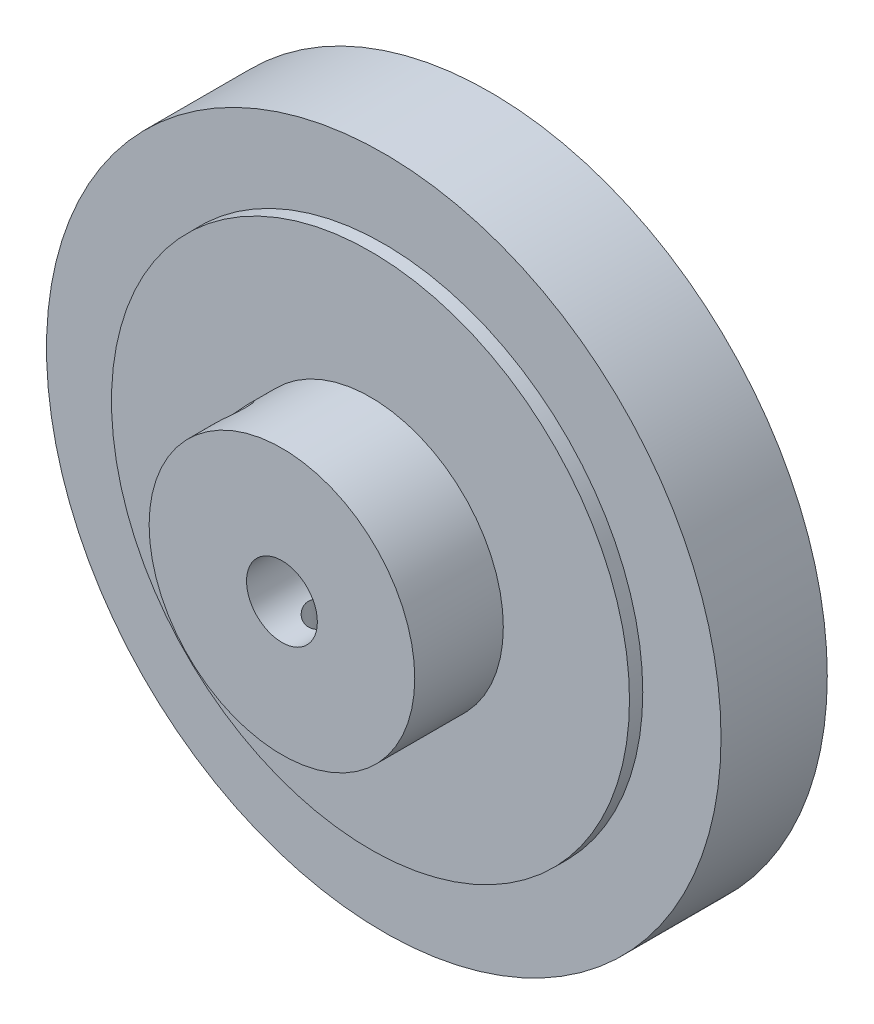
ISO-10303-21;
HEADER;
FILE_DESCRIPTION(('STEP AP214'),'2;1');
FILE_NAME('part.step','',(''),(''),'','','');
FILE_SCHEMA(('AUTOMOTIVE_DESIGN { 1 0 10303 214 1 1 1 1 }'));
ENDSEC;
DATA;
#1=APPLICATION_CONTEXT('core data for automotive mechanical design processes');
#2=APPLICATION_PROTOCOL_DEFINITION('international standard','automotive_design',2000,#1);
#3=PRODUCT_CONTEXT('',#1,'mechanical');
#4=PRODUCT('Part','Part','',(#3));
#5=PRODUCT_RELATED_PRODUCT_CATEGORY('part','',(#4));
#6=PRODUCT_DEFINITION_FORMATION('','',#4);
#7=PRODUCT_DEFINITION_CONTEXT('part definition',#1,'design');
#8=PRODUCT_DEFINITION('design','',#6,#7);
#9=PRODUCT_DEFINITION_SHAPE('','',#8);
#10=(LENGTH_UNIT() NAMED_UNIT(*) SI_UNIT(.MILLI.,.METRE.));
#11=(NAMED_UNIT(*) PLANE_ANGLE_UNIT() SI_UNIT($,.RADIAN.));
#12=(NAMED_UNIT(*) SI_UNIT($,.STERADIAN.) SOLID_ANGLE_UNIT());
#13=UNCERTAINTY_MEASURE_WITH_UNIT(LENGTH_MEASURE(1.E-05),#10,'distance_accuracy_value','');
#14=(GEOMETRIC_REPRESENTATION_CONTEXT(3) GLOBAL_UNCERTAINTY_ASSIGNED_CONTEXT((#13)) GLOBAL_UNIT_ASSIGNED_CONTEXT((#10,
#11,#12)) REPRESENTATION_CONTEXT('',''));
#15=CARTESIAN_POINT('',(0.,0.,0.));
#16=DIRECTION('',(0.,0.,1.));
#17=DIRECTION('',(1.,0.,0.));
#18=AXIS2_PLACEMENT_3D('',#15,#16,#17);
#19=CARTESIAN_POINT('',(0.,0.,6.));
#20=DIRECTION('',(0.,0.,1.));
#21=DIRECTION('',(1.,0.,0.));
#22=AXIS2_PLACEMENT_3D('',#19,#20,#21);
#23=PLANE('',#22);
#24=CARTESIAN_POINT('',(0.,0.,6.));
#25=DIRECTION('',(0.,0.,1.));
#26=DIRECTION('',(1.,0.,0.));
#27=AXIS2_PLACEMENT_3D('',#24,#25,#26);
#28=CIRCLE('',#27,38.087850841627);
#29=CARTESIAN_POINT('',(38.087850841627,0.,6.));
#30=VERTEX_POINT('',#29);
#31=EDGE_CURVE('E12',#30,#30,#28,.T.);
#32=ORIENTED_EDGE('',*,*,#31,.T.);
#33=EDGE_LOOP('',(#32));
#34=FACE_BOUND('',#33,.T.);
#35=CARTESIAN_POINT('',(0.,0.,6.));
#36=DIRECTION('',(0.,0.,1.));
#37=DIRECTION('',(1.,0.,0.));
#38=AXIS2_PLACEMENT_3D('',#35,#36,#37);
#39=CIRCLE('',#38,29.25);
#40=CARTESIAN_POINT('',(29.25,0.,6.));
#41=VERTEX_POINT('',#40);
#42=EDGE_CURVE('E67',#41,#41,#39,.T.);
#43=ORIENTED_EDGE('',*,*,#42,.F.);
#44=EDGE_LOOP('',(#43));
#45=FACE_BOUND('',#44,.T.);
#46=ADVANCED_FACE('F56',(#34,#45),#23,.T.);
#47=CARTESIAN_POINT('',(0.,0.,-6.));
#48=DIRECTION('',(0.,0.,1.));
#49=DIRECTION('',(1.,0.,0.));
#50=AXIS2_PLACEMENT_3D('',#47,#48,#49);
#51=PLANE('',#50);
#52=CARTESIAN_POINT('',(0.,0.,-6.));
#53=DIRECTION('',(0.,0.,1.));
#54=DIRECTION('',(1.,0.,0.));
#55=AXIS2_PLACEMENT_3D('',#52,#53,#54);
#56=CIRCLE('',#55,38.087850841627);
#57=CARTESIAN_POINT('',(38.087850841627,0.,-6.));
#58=VERTEX_POINT('',#57);
#59=EDGE_CURVE('E60',#58,#58,#56,.T.);
#60=ORIENTED_EDGE('',*,*,#59,.F.);
#61=EDGE_LOOP('',(#60));
#62=FACE_BOUND('',#61,.T.);
#63=CARTESIAN_POINT('',(0.,0.,-6.));
#64=DIRECTION('',(0.,0.,1.));
#65=DIRECTION('',(1.,0.,0.));
#66=AXIS2_PLACEMENT_3D('',#63,#64,#65);
#67=CIRCLE('',#66,29.25);
#68=CARTESIAN_POINT('',(29.25,0.,-6.));
#69=VERTEX_POINT('',#68);
#70=EDGE_CURVE('E69',#69,#69,#67,.T.);
#71=ORIENTED_EDGE('',*,*,#70,.T.);
#72=EDGE_LOOP('',(#71));
#73=FACE_BOUND('',#72,.T.);
#74=ADVANCED_FACE('F79',(#62,#73),#51,.F.);
#75=CARTESIAN_POINT('',(0.,0.,6.));
#76=DIRECTION('',(0.,0.,-1.));
#77=DIRECTION('',(-1.,0.,0.));
#78=AXIS2_PLACEMENT_3D('',#75,#76,#77);
#79=CYLINDRICAL_SURFACE('',#78,38.087850841627);
#80=ORIENTED_EDGE('',*,*,#31,.F.);
#81=EDGE_LOOP('',(#80));
#82=FACE_BOUND('',#81,.T.);
#83=ORIENTED_EDGE('',*,*,#59,.T.);
#84=EDGE_LOOP('',(#83));
#85=FACE_BOUND('',#84,.T.);
#86=ADVANCED_FACE('F58',(#82,#85),#79,.T.);
#87=CARTESIAN_POINT('',(0.,0.,6.));
#88=DIRECTION('',(0.,0.,-1.));
#89=DIRECTION('',(-1.,0.,0.));
#90=AXIS2_PLACEMENT_3D('',#87,#88,#89);
#91=CYLINDRICAL_SURFACE('',#90,29.25);
#92=ORIENTED_EDGE('',*,*,#42,.T.);
#93=EDGE_LOOP('',(#92));
#94=FACE_BOUND('',#93,.T.);
#95=ORIENTED_EDGE('',*,*,#70,.F.);
#96=EDGE_LOOP('',(#95));
#97=FACE_BOUND('',#96,.T.);
#98=ADVANCED_FACE('F75',(#94,#97),#91,.F.);
#99=CLOSED_SHELL('',(#46,#74,#86,#98));
#100=MANIFOLD_SOLID_BREP('B2',#99);
#101=CARTESIAN_POINT('',(0.,0.,7.5));
#102=DIRECTION('',(0.,0.,1.));
#103=DIRECTION('',(1.,0.,0.));
#104=AXIS2_PLACEMENT_3D('',#101,#102,#103);
#105=PLANE('',#104);
#106=CARTESIAN_POINT('',(0.,0.,7.5));
#107=DIRECTION('',(0.,0.,1.));
#108=DIRECTION('',(1.,0.,0.));
#109=AXIS2_PLACEMENT_3D('',#106,#107,#108);
#110=CIRCLE('',#109,29.25);
#111=CARTESIAN_POINT('',(29.25,0.,7.5));
#112=VERTEX_POINT('',#111);
#113=EDGE_CURVE('E55',#112,#112,#110,.T.);
#114=ORIENTED_EDGE('',*,*,#113,.T.);
#115=EDGE_LOOP('',(#114));
#116=FACE_BOUND('',#115,.T.);
#117=CARTESIAN_POINT('',(0.,0.,7.5));
#118=DIRECTION('',(0.,0.,1.));
#119=DIRECTION('',(1.,0.,0.));
#120=AXIS2_PLACEMENT_3D('',#117,#118,#119);
#121=CIRCLE('',#120,15.);
#122=CARTESIAN_POINT('',(15.,0.,7.5));
#123=VERTEX_POINT('',#122);
#124=EDGE_CURVE('E268',#123,#123,#121,.F.);
#125=ORIENTED_EDGE('',*,*,#124,.T.);
#126=EDGE_LOOP('',(#125));
#127=FACE_BOUND('',#126,.T.);
#128=ADVANCED_FACE('F147',(#116,#127),#105,.T.);
#129=CARTESIAN_POINT('',(0.,0.,-7.5));
#130=DIRECTION('',(0.,0.,1.));
#131=DIRECTION('',(1.,0.,0.));
#132=AXIS2_PLACEMENT_3D('',#129,#130,#131);
#133=PLANE('',#132);
#134=CARTESIAN_POINT('',(0.,0.,-7.5));
#135=DIRECTION('',(0.,0.,1.));
#136=DIRECTION('',(1.,0.,0.));
#137=AXIS2_PLACEMENT_3D('',#134,#135,#136);
#138=CIRCLE('',#137,4.);
#139=CARTESIAN_POINT('',(4.,0.,-7.5));
#140=VERTEX_POINT('',#139);
#141=EDGE_CURVE('E165',#140,#140,#138,.T.);
#142=ORIENTED_EDGE('',*,*,#141,.T.);
#143=EDGE_LOOP('',(#142));
#144=FACE_BOUND('',#143,.T.);
#145=CARTESIAN_POINT('',(0.,0.,-7.5));
#146=DIRECTION('',(0.,0.,1.));
#147=DIRECTION('',(1.,0.,0.));
#148=AXIS2_PLACEMENT_3D('',#145,#146,#147);
#149=CIRCLE('',#148,29.25);
#150=CARTESIAN_POINT('',(29.25,0.,-7.5));
#151=VERTEX_POINT('',#150);
#152=EDGE_CURVE('E160',#151,#151,#149,.T.);
#153=ORIENTED_EDGE('',*,*,#152,.F.);
#154=EDGE_LOOP('',(#153));
#155=FACE_BOUND('',#154,.T.);
#156=ADVANCED_FACE('F187',(#144,#155),#133,.F.);
#157=CARTESIAN_POINT('',(0.,0.,7.5));
#158=DIRECTION('',(0.,0.,-1.));
#159=DIRECTION('',(-1.,0.,0.));
#160=AXIS2_PLACEMENT_3D('',#157,#158,#159);
#161=CYLINDRICAL_SURFACE('',#160,29.25);
#162=ORIENTED_EDGE('',*,*,#113,.F.);
#163=EDGE_LOOP('',(#162));
#164=FACE_BOUND('',#163,.T.);
#165=ORIENTED_EDGE('',*,*,#152,.T.);
#166=EDGE_LOOP('',(#165));
#167=FACE_BOUND('',#166,.T.);
#168=ADVANCED_FACE('F180',(#164,#167),#161,.T.);
#169=CARTESIAN_POINT('',(0.,0.,7.5));
#170=DIRECTION('',(0.,0.,-1.));
#171=DIRECTION('',(-1.,0.,0.));
#172=AXIS2_PLACEMENT_3D('',#169,#170,#171);
#173=CYLINDRICAL_SURFACE('',#172,4.);
#174=CARTESIAN_POINT('',(-2.68211773936538,2.96753170702211,14.4897913040149));
#175=CARTESIAN_POINT('',(-2.60247658691988,3.03950561769853,14.4789111500052));
#176=CARTESIAN_POINT('',(-2.52046117093615,3.10775252527428,14.4593349794723));
#177=CARTESIAN_POINT('',(-2.35478356226027,3.23511662586228,14.4037000321545));
#178=CARTESIAN_POINT('',(-2.27111793799265,3.29421187781548,14.3676024397434));
#179=CARTESIAN_POINT('',(-2.10568869205158,3.40232184713856,14.2806071712196));
#180=CARTESIAN_POINT('',(-2.02391800954054,3.45138237851424,14.2297794411821));
#181=CARTESIAN_POINT('',(-1.86471356994642,3.53993684182264,14.1148677299191));
#182=CARTESIAN_POINT('',(-1.78727927843582,3.57943195462469,14.0507853868139));
#183=CARTESIAN_POINT('',(-1.63413133043571,3.65202590314484,13.9058721900629));
#184=CARTESIAN_POINT('',(-1.55892600871416,3.68447545478821,13.8241777554469));
#185=CARTESIAN_POINT('',(-1.41974574000493,3.74031509102578,13.6488798318796));
#186=CARTESIAN_POINT('',(-1.35577772336222,3.76369959561589,13.5552690547438));
#187=CARTESIAN_POINT('',(-1.24049378700034,3.80329320999209,13.3541764540075));
#188=CARTESIAN_POINT('',(-1.18974707843153,3.81919790122371,13.2463042299773));
#189=CARTESIAN_POINT('',(-1.10833920908136,3.84362137846534,13.0224826231945));
#190=CARTESIAN_POINT('',(-1.07765007560515,3.85215045604436,12.9065447398918));
#191=CARTESIAN_POINT('',(-1.04149107553757,3.8620731195754,12.6831027336599));
#192=CARTESIAN_POINT('',(-1.03369600705651,3.86412631901979,12.5760045386242));
#193=CARTESIAN_POINT('',(-1.03738912411205,3.86313751608401,12.3621792828687));
#194=CARTESIAN_POINT('',(-1.0488721428707,3.86009687891873,12.2554521303865));
#195=CARTESIAN_POINT('',(-1.08827959302591,3.84915664193169,12.0546813356769));
#196=CARTESIAN_POINT('',(-1.11475422269457,3.84168305390126,11.9603218785873));
#197=CARTESIAN_POINT('',(-1.18111099189795,3.82180198312283,11.7770108157825));
#198=CARTESIAN_POINT('',(-1.22099735776743,3.80939294487964,11.6880609251882));
#199=CARTESIAN_POINT('',(-1.31563226108141,3.77780176365821,11.5102855180073));
#200=CARTESIAN_POINT('',(-1.37131632439094,3.75815615942432,11.4220423272347));
#201=CARTESIAN_POINT('',(-1.4930161672143,3.71148903825109,11.2551258982707));
#202=CARTESIAN_POINT('',(-1.55903823693167,3.68446302317163,11.1764585386726));
#203=CARTESIAN_POINT('',(-1.70698978173929,3.61849104975369,11.021443142041));
#204=CARTESIAN_POINT('',(-1.78987645964506,3.578522589833,10.9464353223854));
#205=CARTESIAN_POINT('',(-1.96179651948145,3.48723638285623,10.8118958152264));
#206=CARTESIAN_POINT('',(-2.05083011365958,3.43591824377098,10.7523646624568));
#207=CARTESIAN_POINT('',(-2.23071055594669,3.32192241440811,10.6512524159522));
#208=CARTESIAN_POINT('',(-2.32153856807974,3.25933368582264,10.6095388108071));
#209=CARTESIAN_POINT('',(-2.50172438613862,3.12315286363814,10.545411001869));
#210=CARTESIAN_POINT('',(-2.5910834502858,3.04957079701447,10.522979335729));
#211=CARTESIAN_POINT('',(-2.7558228423433,2.90112025268051,10.49985385966));
#212=CARTESIAN_POINT('',(-2.83170874646366,2.82711088790442,10.4972163583846));
#213=CARTESIAN_POINT('',(-2.97673481034,2.6739784088401,10.5086921702302));
#214=CARTESIAN_POINT('',(-3.0458761442788,2.59485618866612,10.522802562007));
#215=CARTESIAN_POINT('',(-3.17289529900167,2.43772762081944,10.5661235652493));
#216=CARTESIAN_POINT('',(-3.23112994758997,2.35981995097774,10.5946577359772));
#217=CARTESIAN_POINT('',(-3.33914122599236,2.20433788036981,10.6653215913879));
#218=CARTESIAN_POINT('',(-3.38891622296289,2.12676354675267,10.7074538961816));
#219=CARTESIAN_POINT('',(-3.48282900981359,1.96947251880298,10.8071028830626));
#220=CARTESIAN_POINT('',(-3.52640449291071,1.88993493382665,10.8654296304978));
#221=CARTESIAN_POINT('',(-3.60438820358186,1.73660550246787,10.9944894685931));
#222=CARTESIAN_POINT('',(-3.63879051186681,1.66281738774571,11.0652305214114));
#223=CARTESIAN_POINT('',(-3.70215030842294,1.51690607738248,11.2251135023651));
#224=CARTESIAN_POINT('',(-3.73025971642984,1.44563369795748,11.315373254166));
#225=CARTESIAN_POINT('',(-3.77765089147335,1.31684314496323,11.5073740755893));
#226=CARTESIAN_POINT('',(-3.79693137495444,1.25932697186161,11.6091168119381));
#227=CARTESIAN_POINT('',(-3.82781790594151,1.1620772339537,11.821615784225));
#228=CARTESIAN_POINT('',(-3.83944440089992,1.12229638229173,11.9323471099398));
#229=CARTESIAN_POINT('',(-3.85602262959907,1.06397603260736,12.1596950318305));
#230=CARTESIAN_POINT('',(-3.86098423035868,1.04540514049449,12.2763026623113));
#231=CARTESIAN_POINT('',(-3.8644960510307,1.03232437396246,12.496402954492));
#232=CARTESIAN_POINT('',(-3.86376457388994,1.03511805171536,12.5997301897432));
#233=CARTESIAN_POINT('',(-3.85750110140889,1.05821813025554,12.804255959286));
#234=CARTESIAN_POINT('',(-3.85196851573856,1.07852668461811,12.9054542302392));
#235=CARTESIAN_POINT('',(-3.83604970677892,1.13379762390535,13.098739250685));
#236=CARTESIAN_POINT('',(-3.82587347218039,1.16811986852121,13.1910297067874));
#237=CARTESIAN_POINT('',(-3.80018657316617,1.24915301256108,13.3691844271794));
#238=CARTESIAN_POINT('',(-3.78467413311647,1.29586803452334,13.4550465408292));
#239=CARTESIAN_POINT('',(-3.74558248722239,1.40510770048748,13.6280122795089));
#240=CARTESIAN_POINT('',(-3.72130459179533,1.46880501577173,13.7142171512197));
#241=CARTESIAN_POINT('',(-3.66431005566603,1.60571873302021,13.8756182957449));
#242=CARTESIAN_POINT('',(-3.63158843132963,1.67894074392381,13.9508080260058));
#243=CARTESIAN_POINT('',(-3.55328128830264,1.83925597165375,14.0951484552865));
#244=CARTESIAN_POINT('',(-3.50678110669722,1.92700596011617,14.1630832721656));
#245=CARTESIAN_POINT('',(-3.40176578838745,2.10684825166604,14.2819234023611));
#246=CARTESIAN_POINT('',(-3.34325037634998,2.19894065422413,14.3328283253613));
#247=CARTESIAN_POINT('',(-3.21716698548215,2.37937218497532,14.4135910065632));
#248=CARTESIAN_POINT('',(-3.1501137631261,2.46769719530687,14.4442799658788));
#249=CARTESIAN_POINT('',(-3.00641026079747,2.64084587952315,14.4864792847563));
#250=CARTESIAN_POINT('',(-2.92978663541349,2.72567844010432,14.4980416870763));
#251=CARTESIAN_POINT('',(-2.82248539791167,2.83462491383244,14.500359983861));
#252=CARTESIAN_POINT('',(-2.7948949850676,2.86182819639373,14.4998150304916));
#253=CARTESIAN_POINT('',(-2.73901098154115,2.91535838125762,14.4964841665536));
#254=CARTESIAN_POINT('',(-2.7107174505689,2.94168535753662,14.4936984456492));
#255=CARTESIAN_POINT('',(-2.68211773936538,2.96753170702211,14.4897913040149));
#256=B_SPLINE_CURVE_WITH_KNOTS('',3,(#174,#175,#176,#177,#178,#179,#180,#181,#182,#183,#184,
#185,#186,#187,#188,#189,#190,#191,#192,#193,#194,#195,#196,#197,#198,#199,#200,#201,#202,#203,
#204,#205,#206,#207,#208,#209,#210,#211,#212,#213,#214,#215,#216,#217,#218,#219,#220,#221,#222,
#223,#224,#225,#226,#227,#228,#229,#230,#231,#232,#233,#234,#235,#236,#237,#238,#239,#240,#241,
#242,#243,#244,#245,#246,#247,#248,#249,#250,#251,#252,#253,#254,#255),.UNSPECIFIED.,.T.,.F.,(4,
2,2,2,2,2,2,2,2,2,2,2,2,2,2,2,2,2,2,2,2,2,2,2,2,2,2,2,2,2,2,2,2,2,2,2,2,2,2,2,4),(0.,
0.323524330585441,0.647812686016307,0.970585705725638,1.29331885815042,1.63885985207784,
1.98461320784391,2.34342737660722,2.701740062081,3.02213318910399,3.34244046031204,
3.63605649159951,3.92976513464087,4.24703373615886,4.56449613664261,4.91897860963358,
5.27347332871346,5.625283672541,5.97677506886109,6.29323499039282,6.60963971975531,
6.9124188532336,7.21525636156014,7.53741608590769,7.85978319394344,8.21331984301296,
8.56690787319496,8.91954742606477,9.27166433746787,9.58014720667539,9.88866801139482,
10.1844412961114,10.4803130953886,10.808670176814,11.1372215052887,11.4963926443176,
11.8555720147944,12.1988677049904,12.5412277526643,12.6574175024864,12.7735974187476),.UNSPECIFIED.);
#257=CARTESIAN_POINT('',(-2.68211773936538,2.96753170702211,14.4897913040149));
#258=VERTEX_POINT('',#257);
#259=EDGE_CURVE('E169',#258,#258,#256,.T.);
#260=ORIENTED_EDGE('',*,*,#259,.T.);
#261=EDGE_LOOP('',(#260));
#262=FACE_BOUND('',#261,.T.);
#263=CARTESIAN_POINT('',(0.,-4.,14.5));
#264=CARTESIAN_POINT('',(-0.105143925902467,-3.99999426810082,14.4999933953656));
#265=CARTESIAN_POINT('',(-0.210413199395125,-3.99580982039513,14.4916598537579));
#266=CARTESIAN_POINT('',(-0.417840470537792,-3.97948312074314,14.4586942393169));
#267=CARTESIAN_POINT('',(-0.519992173427259,-3.96732575657839,14.4340312140044));
#268=CARTESIAN_POINT('',(-0.717867089760898,-3.93632558806751,14.3696123827667));
#269=CARTESIAN_POINT('',(-0.813613605878293,-3.91750878355075,14.3299152315041));
#270=CARTESIAN_POINT('',(-0.996945233613197,-3.87491553031523,14.23685875727));
#271=CARTESIAN_POINT('',(-1.08453098798012,-3.85113947267051,14.1835005115023));
#272=CARTESIAN_POINT('',(-1.25501563552382,-3.79912516516124,14.0609655010294));
#273=CARTESIAN_POINT('',(-1.33731042224422,-3.77070398255074,13.9910270415207));
#274=CARTESIAN_POINT('',(-1.48955888973396,-3.71319940493486,13.8389570415059));
#275=CARTESIAN_POINT('',(-1.55950316621353,-3.68411552418069,13.7568162964551));
#276=CARTESIAN_POINT('',(-1.69050400090055,-3.62597902394695,13.5750333009532));
#277=CARTESIAN_POINT('',(-1.75045067110327,-3.59710373940264,13.4745278033082));
#278=CARTESIAN_POINT('',(-1.85233645378139,-3.54571957544641,13.2632653280276));
#279=CARTESIAN_POINT('',(-1.89428842993267,-3.52320615213979,13.1525157425545));
#280=CARTESIAN_POINT('',(-1.95626488437718,-3.48915734075617,12.9306697891562));
#281=CARTESIAN_POINT('',(-1.97745171416088,-3.47704543167427,12.8199910958652));
#282=CARTESIAN_POINT('',(-2.00085398661769,-3.46363779897055,12.596042324441));
#283=CARTESIAN_POINT('',(-2.00308817674615,-3.46233138686576,12.4827749182577));
#284=CARTESIAN_POINT('',(-1.98937457434459,-3.47021860514497,12.2714279513693));
#285=CARTESIAN_POINT('',(-1.97556911907364,-3.47817527324027,12.1731519375539));
#286=CARTESIAN_POINT('',(-1.93387969811386,-3.50152457467701,11.9805561812539));
#287=CARTESIAN_POINT('',(-1.9059912477953,-3.51691957663553,11.8862377093894));
#288=CARTESIAN_POINT('',(-1.83641956077201,-3.55374952825482,11.7015417348687));
#289=CARTESIAN_POINT('',(-1.79443013423199,-3.57531681327997,11.6113072024284));
#290=CARTESIAN_POINT('',(-1.698083375336,-3.62206808562807,11.43873141482));
#291=CARTESIAN_POINT('',(-1.64372048762493,-3.64725369560381,11.3563937287998));
#292=CARTESIAN_POINT('',(-1.51613210982558,-3.70226315806572,11.1909574945135));
#293=CARTESIAN_POINT('',(-1.44138891673856,-3.73227020473492,11.1090862528477));
#294=CARTESIAN_POINT('',(-1.27911115748275,-3.79095246600814,10.9585291628182));
#295=CARTESIAN_POINT('',(-1.19157051314857,-3.81962703917602,10.8898496159322));
#296=CARTESIAN_POINT('',(-1.0010330116637,-3.87403974565928,10.7646286779405));
#297=CARTESIAN_POINT('',(-0.897507183198818,-3.89957968324015,10.7087990551085));
#298=CARTESIAN_POINT('',(-0.680932430977594,-3.94315762242485,10.615805941914));
#299=CARTESIAN_POINT('',(-0.567891152530552,-3.96120157887106,10.5786276299697));
#300=CARTESIAN_POINT('',(-0.345532983321404,-3.98648667482871,10.5270491925666));
#301=CARTESIAN_POINT('',(-0.236683061096652,-3.9944987660262,10.5110175285064));
#302=CARTESIAN_POINT('',(-0.0175591998987035,-4.00146026918207,10.497070537731));
#303=CARTESIAN_POINT('',(0.0927140397398173,-4.00041397442637,10.4991466287211));
#304=CARTESIAN_POINT('',(0.302465943971974,-3.9898238450687,10.5204133768375));
#305=CARTESIAN_POINT('',(0.40211881609986,-3.98094491376337,10.53826506546));
#306=CARTESIAN_POINT('',(0.596813784603882,-3.9564434262968,10.5884761437902));
#307=CARTESIAN_POINT('',(0.691855371382174,-3.94082012668824,10.620837132907));
#308=CARTESIAN_POINT('',(0.877777216899145,-3.90368502827176,10.6999969328661));
#309=CARTESIAN_POINT('',(0.968460794011607,-3.88201763539262,10.7471821002326));
#310=CARTESIAN_POINT('',(1.14092272339854,-3.83487948634835,10.8542150712931));
#311=CARTESIAN_POINT('',(1.22269725955318,-3.80940711133877,10.9140682691908));
#312=CARTESIAN_POINT('',(1.38353537857843,-3.75416442672396,11.0515208506614));
#313=CARTESIAN_POINT('',(1.46154415563805,-3.72421769686998,11.1302857368903));
#314=CARTESIAN_POINT('',(1.60371264223771,-3.6652478321764,11.2998503025555));
#315=CARTESIAN_POINT('',(1.66786277142375,-3.63622534800094,11.3906582376958));
#316=CARTESIAN_POINT('',(1.78341582895804,-3.58102384412979,11.587287308346));
#317=CARTESIAN_POINT('',(1.8340509916005,-3.55505059178121,11.693622532189));
#318=CARTESIAN_POINT('',(1.91616565186941,-3.51148144588269,11.9150201351499));
#319=CARTESIAN_POINT('',(1.94766983173403,-3.493874764435,12.0300710529338));
#320=CARTESIAN_POINT('',(1.98772337493374,-3.47123002051604,12.2538204457694));
#321=CARTESIAN_POINT('',(1.9981859928109,-3.4651476693013,12.3620685068705));
#322=CARTESIAN_POINT('',(2.0013783087524,-3.46330709283207,12.578894134329));
#323=CARTESIAN_POINT('',(1.99411569324648,-3.4675443925278,12.6874715374757));
#324=CARTESIAN_POINT('',(1.96385225118662,-3.48475724102153,12.8909670030669));
#325=CARTESIAN_POINT('',(1.94241662868607,-3.49686188965317,12.9862009402895));
#326=CARTESIAN_POINT('',(1.88635071644882,-3.52742032375305,13.1716162388487));
#327=CARTESIAN_POINT('',(1.85171618231984,-3.54587615139337,13.2617959641841));
#328=CARTESIAN_POINT('',(1.76763149060113,-3.58857060729071,13.4412497019731));
#329=CARTESIAN_POINT('',(1.7173422756314,-3.61311444791841,13.5300558036581));
#330=CARTESIAN_POINT('',(1.60430194327478,-3.66470663269721,13.6985490723625));
#331=CARTESIAN_POINT('',(1.54154434248312,-3.69175627591221,13.7782314610422));
#332=CARTESIAN_POINT('',(1.39640665332275,-3.74924646316184,13.9362839647094));
#333=CARTESIAN_POINT('',(1.31256884599452,-3.77969966613256,14.0133182047006));
#334=CARTESIAN_POINT('',(1.1323096124664,-3.83755504519861,14.1525259668705));
#335=CARTESIAN_POINT('',(1.0358814466104,-3.8649555725239,14.2146914789398));
#336=CARTESIAN_POINT('',(0.831863193565892,-3.91396019133075,14.3224727254241));
#337=CARTESIAN_POINT('',(0.724199007553462,-3.93552192987866,14.3679683384729));
#338=CARTESIAN_POINT('',(0.501484202276173,-3.97002682597974,14.4396163355148));
#339=CARTESIAN_POINT('',(0.3864555991782,-3.98299446726136,14.4658236936114));
#340=CARTESIAN_POINT('',(0.22520389298179,-3.99390923826956,14.4877948221715));
#341=CARTESIAN_POINT('',(0.18032375888313,-3.99618730680502,14.4923652817327));
#342=CARTESIAN_POINT('',(0.0903034636101832,-3.99923393953631,14.4984693310282));
#343=CARTESIAN_POINT('',(0.0451632952932569,-4.00000246206762,14.5000028369404));
#344=CARTESIAN_POINT('',(0.,-4.,14.5));
#345=B_SPLINE_CURVE_WITH_KNOTS('',3,(#263,#264,#265,#266,#267,#268,#269,#270,#271,#272,#273,
#274,#275,#276,#277,#278,#279,#280,#281,#282,#283,#284,#285,#286,#287,#288,#289,#290,#291,#292,
#293,#294,#295,#296,#297,#298,#299,#300,#301,#302,#303,#304,#305,#306,#307,#308,#309,#310,#311,
#312,#313,#314,#315,#316,#317,#318,#319,#320,#321,#322,#323,#324,#325,#326,#327,#328,#329,#330,
#331,#332,#333,#334,#335,#336,#337,#338,#339,#340,#341,#342,#343,#344),.UNSPECIFIED.,.T.,.F.,(4,
2,2,2,2,2,2,2,2,2,2,2,2,2,2,2,2,2,2,2,2,2,2,2,2,2,2,2,2,2,2,2,2,2,2,2,2,2,2,2,4),(0.,
0.315248514840585,0.631096299418395,0.945724310984596,1.26032752116314,1.59396351743618,
1.92785247530807,2.28763452861505,2.64715895796562,2.98516024280459,3.32282714658041,
3.62011424818641,3.91749607851357,4.22180480336975,4.52625042520444,4.86929882667757,
5.21251069197373,5.57166044428881,5.93052433824559,6.25966580942691,6.58865129022952,
6.89213813012244,7.19565843261863,7.50785712055797,7.82018901496678,8.16319221288837,
8.50643177230863,8.86629364323451,9.22569023890902,9.55058615006093,9.87534119729357,
10.1691586049771,10.463070575767,10.7767291356057,11.0905512228726,11.4425048551434,
11.7946476676249,12.1492802732705,12.502898172423,12.6383056026783,12.7737167702213),.UNSPECIFIED.);
#346=CARTESIAN_POINT('',(0.,-4.,14.5));
#347=VERTEX_POINT('',#346);
#348=EDGE_CURVE('E242',#347,#347,#345,.T.);
#349=ORIENTED_EDGE('',*,*,#348,.T.);
#350=EDGE_LOOP('',(#349));
#351=FACE_BOUND('',#350,.T.);
#352=ORIENTED_EDGE('',*,*,#141,.F.);
#353=EDGE_LOOP('',(#352));
#354=FACE_BOUND('',#353,.T.);
#355=CARTESIAN_POINT('',(0.,0.,17.5));
#356=DIRECTION('',(0.,0.,1.));
#357=DIRECTION('',(1.,0.,0.));
#358=AXIS2_PLACEMENT_3D('',#355,#356,#357);
#359=CIRCLE('',#358,4.);
#360=CARTESIAN_POINT('',(4.,0.,17.5));
#361=VERTEX_POINT('',#360);
#362=EDGE_CURVE('E249',#361,#361,#359,.T.);
#363=ORIENTED_EDGE('',*,*,#362,.T.);
#364=EDGE_LOOP('',(#363));
#365=FACE_BOUND('',#364,.T.);
#366=ADVANCED_FACE('F175',(#262,#351,#354,#365),#173,.F.);
#367=CARTESIAN_POINT('',(0.,0.,17.5));
#368=DIRECTION('',(0.,0.,1.));
#369=DIRECTION('',(1.,0.,0.));
#370=AXIS2_PLACEMENT_3D('',#367,#368,#369);
#371=PLANE('',#370);
#372=CARTESIAN_POINT('',(0.,0.,17.5));
#373=DIRECTION('',(0.,0.,1.));
#374=DIRECTION('',(1.,0.,0.));
#375=AXIS2_PLACEMENT_3D('',#372,#373,#374);
#376=CIRCLE('',#375,15.);
#377=CARTESIAN_POINT('',(15.,0.,17.5));
#378=VERTEX_POINT('',#377);
#379=EDGE_CURVE('E266',#378,#378,#376,.T.);
#380=ORIENTED_EDGE('',*,*,#379,.T.);
#381=EDGE_LOOP('',(#380));
#382=FACE_BOUND('',#381,.T.);
#383=ORIENTED_EDGE('',*,*,#362,.F.);
#384=EDGE_LOOP('',(#383));
#385=FACE_BOUND('',#384,.T.);
#386=ADVANCED_FACE('F179',(#382,#385),#371,.T.);
#387=CARTESIAN_POINT('',(0.,0.,17.5));
#388=DIRECTION('',(0.,0.,-1.));
#389=DIRECTION('',(-1.,0.,0.));
#390=AXIS2_PLACEMENT_3D('',#387,#388,#389);
#391=CYLINDRICAL_SURFACE('',#390,15.);
#392=CARTESIAN_POINT('',(-10.7661580980777,10.4446081691558,14.4870336739988));
#393=CARTESIAN_POINT('',(-10.688947711126,10.5241931887288,14.4997156373459));
#394=CARTESIAN_POINT('',(-10.6100607690926,10.6037267537695,14.5031061922901));
#395=CARTESIAN_POINT('',(-10.4511852816755,10.7603532601567,14.4911579239387));
#396=CARTESIAN_POINT('',(-10.3711957347132,10.8374437394201,14.4758007867033));
#397=CARTESIAN_POINT('',(-10.212605077598,10.9870183186256,14.4268111394454));
#398=CARTESIAN_POINT('',(-10.1340031647207,11.0595051492592,14.3931895783567));
#399=CARTESIAN_POINT('',(-9.98061517779606,11.1981256530406,14.3086679010773));
#400=CARTESIAN_POINT('',(-9.9058285106678,11.2642603150542,14.2577704798956));
#401=CARTESIAN_POINT('',(-9.76215398580282,11.3890057806529,14.1398818212413));
#402=CARTESIAN_POINT('',(-9.69329392138029,11.447581716015,14.0728198249301));
#403=CARTESIAN_POINT('',(-9.56417081183656,11.555680053993,13.9245961087988));
#404=CARTESIAN_POINT('',(-9.50390836544524,11.6052018261531,13.8434334078911));
#405=CARTESIAN_POINT('',(-9.39374120747958,11.6945587094088,13.668679259263));
#406=CARTESIAN_POINT('',(-9.34390640121057,11.7343287334416,13.5750104191649));
#407=CARTESIAN_POINT('',(-9.2569440189863,11.8030535266452,13.378275708599));
#408=CARTESIAN_POINT('',(-9.21981617339458,11.8320085253075,13.2752100375869));
#409=CARTESIAN_POINT('',(-9.15979285440346,11.8785370596925,13.06290723072));
#410=CARTESIAN_POINT('',(-9.13685608036885,11.896143629345,12.9536890226801));
#411=CARTESIAN_POINT('',(-9.10596136805465,11.9198092503977,12.7319353148835));
#412=CARTESIAN_POINT('',(-9.09800257522772,11.9258689605878,12.6194000047514));
#413=CARTESIAN_POINT('',(-9.09738751312324,11.9263380557723,12.3951567678502));
#414=CARTESIAN_POINT('',(-9.10461075564075,11.9208391724586,12.2834493340349));
#415=CARTESIAN_POINT('',(-9.13382533653886,11.898469149479,12.0631498872992));
#416=CARTESIAN_POINT('',(-9.15581666677761,11.8815980160829,11.9545578726613));
#417=CARTESIAN_POINT('',(-9.21368754737939,11.8367770323118,11.7436009690489));
#418=CARTESIAN_POINT('',(-9.24956027395288,11.808832625153,11.6412330490117));
#419=CARTESIAN_POINT('',(-9.33383324190496,11.7423347651465,11.4454945275332));
#420=CARTESIAN_POINT('',(-9.38223411333035,11.7037807787316,11.3521243789185));
#421=CARTESIAN_POINT('',(-9.49021706405742,11.6163947485229,11.1762618202449));
#422=CARTESIAN_POINT('',(-9.5498822143261,11.5674859930613,11.0938585222196));
#423=CARTESIAN_POINT('',(-9.67803484835171,11.4604797320359,10.943066203399));
#424=CARTESIAN_POINT('',(-9.74652257046266,11.402381978209,10.8746775613585));
#425=CARTESIAN_POINT('',(-9.89026989237633,11.2779262604085,10.7536009131129));
#426=CARTESIAN_POINT('',(-9.96555493872656,11.21153686775,10.7009753824178));
#427=CARTESIAN_POINT('',(-10.1201668670294,11.072174213347,10.6133195869462));
#428=CARTESIAN_POINT('',(-10.1994935806849,10.9992012256492,10.5782885901831));
#429=CARTESIAN_POINT('',(-10.3591811691332,10.8489312578131,10.5270163237761));
#430=CARTESIAN_POINT('',(-10.4395332801586,10.7716620681485,10.5106663408865));
#431=CARTESIAN_POINT('',(-10.5992875258746,10.6145021295755,10.4968812443417));
#432=CARTESIAN_POINT('',(-10.6786897013873,10.5346114938761,10.4994453149369));
#433=CARTESIAN_POINT('',(-10.8337771540356,10.3750458500873,10.5233306714776));
#434=CARTESIAN_POINT('',(-10.9094830631177,10.2953727631526,10.5445311367977));
#435=CARTESIAN_POINT('',(-11.0557514309998,10.138140728662,10.6048954792004));
#436=CARTESIAN_POINT('',(-11.1263137908556,10.0605818217936,10.6440597017384));
#437=CARTESIAN_POINT('',(-11.2608159974978,9.90980675706159,10.7393561266196));
#438=CARTESIAN_POINT('',(-11.3247360539117,9.83660383975302,10.7955371868659));
#439=CARTESIAN_POINT('',(-11.444346356976,9.69718448131303,10.9232380301712));
#440=CARTESIAN_POINT('',(-11.500036167655,9.63096841034095,10.9947586253021));
#441=CARTESIAN_POINT('',(-11.6024945136371,9.50729370318593,11.1517718887953));
#442=CARTESIAN_POINT('',(-11.6491901019801,9.44990737642319,11.2373691523531));
#443=CARTESIAN_POINT('',(-11.7322566539833,9.34658026377952,11.4197533533245));
#444=CARTESIAN_POINT('',(-11.7686275762398,9.30063952379746,11.5165403356085));
#445=CARTESIAN_POINT('',(-11.8304300134041,9.22190028312033,11.7186697036973));
#446=CARTESIAN_POINT('',(-11.855854103679,9.18911070316153,11.8240178386711));
#447=CARTESIAN_POINT('',(-11.8952893931551,9.13800534425215,12.0402167303812));
#448=CARTESIAN_POINT('',(-11.9093011978581,9.11968879740722,12.1510671948493));
#449=CARTESIAN_POINT('',(-11.9256123628447,9.09834884442504,12.3742190081587));
#450=CARTESIAN_POINT('',(-11.9280002159312,9.09520989293506,12.4865028490726));
#451=CARTESIAN_POINT('',(-11.9212633121226,9.10403814632153,12.710124941947));
#452=CARTESIAN_POINT('',(-11.9121388342919,9.1160049850265,12.8214632167626));
#453=CARTESIAN_POINT('',(-11.8825908730846,9.15448592856406,13.0395786317473));
#454=CARTESIAN_POINT('',(-11.8622126651343,9.18094173860331,13.1463722135468));
#455=CARTESIAN_POINT('',(-11.8105293205721,9.2473323775659,13.3528870644681));
#456=CARTESIAN_POINT('',(-11.7792240993552,9.28726731085469,13.4526082788231));
#457=CARTESIAN_POINT('',(-11.706003510779,9.37938970294042,13.6427888501894));
#458=CARTESIAN_POINT('',(-11.6640276765163,9.43164686130265,13.733191152958));
#459=CARTESIAN_POINT('',(-11.5702873639856,9.54640900835212,13.9016008569697));
#460=CARTESIAN_POINT('',(-11.5185204291156,9.60891656835602,13.9796051384719));
#461=CARTESIAN_POINT('',(-11.4057952531842,9.74245937110945,14.1215319866491));
#462=CARTESIAN_POINT('',(-11.3447750749136,9.81355136646423,14.1853519177557));
#463=CARTESIAN_POINT('',(-11.2151307496104,9.96144924771843,14.2963361103775));
#464=CARTESIAN_POINT('',(-11.1465146169201,10.0382490837856,14.3435177107068));
#465=CARTESIAN_POINT('',(-11.0258734382449,10.1703209524408,14.4078762166684));
#466=CARTESIAN_POINT('',(-10.9754243726353,10.2247600935445,14.4298229382834));
#467=CARTESIAN_POINT('',(-10.8723042975137,10.3343437769157,14.4650099288388));
#468=CARTESIAN_POINT('',(-10.8196333044981,10.3894883139439,14.4782502624065));
#469=CARTESIAN_POINT('',(-10.7661580980777,10.4446081691558,14.4870336739988));
#470=B_SPLINE_CURVE_WITH_KNOTS('',3,(#392,#393,#394,#395,#396,#397,#398,#399,#400,#401,#402,
#403,#404,#405,#406,#407,#408,#409,#410,#411,#412,#413,#414,#415,#416,#417,#418,#419,#420,#421,
#422,#423,#424,#425,#426,#427,#428,#429,#430,#431,#432,#433,#434,#435,#436,#437,#438,#439,#440,
#441,#442,#443,#444,#445,#446,#447,#448,#449,#450,#451,#452,#453,#454,#455,#456,#457,#458,#459,
#460,#461,#462,#463,#464,#465,#466,#467,#468,#469),.UNSPECIFIED.,.T.,.F.,(4,2,2,2,2,2,2,2,2,2,2,
2,2,2,2,2,2,2,2,2,2,2,2,2,2,2,2,2,2,2,2,2,2,2,2,2,2,2,4),(0.,0.334538838789927,
0.669404738089608,1.00407011723376,1.33868331304148,1.67478873070454,2.01091754301376,
2.34923221657736,2.68753971079819,3.02485793081562,3.36215690503968,3.69678910652283,
4.03142112351836,4.36588885130716,4.7003734029174,5.03742852927396,5.37449276355235,
5.71287575962231,6.05124467675452,6.38763427949453,6.72400937407623,7.05821968424849,
7.39243642178318,7.72762199122631,8.06282530971306,8.40064228426985,8.73846061351129,
9.07650770676018,9.41453686307162,9.74998854503294,10.0854320956434,10.4195358362164,
10.7536421637295,11.0896856937789,11.425813649772,11.7642998474866,12.1024322588557,
12.3341325126957,12.5658310466134),.UNSPECIFIED.);
#471=CARTESIAN_POINT('',(-10.7661580980777,10.4446081691558,14.4870336739988));
#472=VERTEX_POINT('',#471);
#473=EDGE_CURVE('E152',#472,#472,#470,.T.);
#474=ORIENTED_EDGE('',*,*,#473,.F.);
#475=EDGE_LOOP('',(#474));
#476=FACE_BOUND('',#475,.T.);
#477=CARTESIAN_POINT('',(0.,-15.,14.5));
#478=CARTESIAN_POINT('',(-0.111808835669284,-14.9999983574254,14.4999952902931));
#479=CARTESIAN_POINT('',(-0.22368597927628,-14.9987367072719,14.4905924620375));
#480=CARTESIAN_POINT('',(-0.444322725138079,-14.993825111269,14.4532336509504));
#481=CARTESIAN_POINT('',(-0.553079022333037,-14.9901727244172,14.4252587051029));
#482=CARTESIAN_POINT('',(-0.764248312626984,-14.9808907984907,14.3515982824586));
#483=CARTESIAN_POINT('',(-0.866665683058495,-14.9752626421097,14.3059251889616));
#484=CARTESIAN_POINT('',(-1.0623638950303,-14.9626538666039,14.1981930861937));
#485=CARTESIAN_POINT('',(-1.15564620633703,-14.9556734655857,14.1361367188335));
#486=CARTESIAN_POINT('',(-1.33102582250468,-14.9410899478996,13.9969867383958));
#487=CARTESIAN_POINT('',(-1.41305798549586,-14.9334835816211,13.9198113549915));
#488=CARTESIAN_POINT('',(-1.56304735673102,-14.9185313755795,13.7527898109233));
#489=CARTESIAN_POINT('',(-1.63100381997221,-14.9111855496234,13.6629429800042));
#490=CARTESIAN_POINT('',(-1.75115902268907,-14.8975543544019,13.472700877055));
#491=CARTESIAN_POINT('',(-1.80329607482578,-14.8912731776576,13.3722663175214));
#492=CARTESIAN_POINT('',(-1.8899384500729,-14.8805258737923,13.1639689327632));
#493=CARTESIAN_POINT('',(-1.92444453245278,-14.8760596685121,13.0561064276467));
#494=CARTESIAN_POINT('',(-1.97464606772174,-14.8694793656867,12.8366941894983));
#495=CARTESIAN_POINT('',(-1.99045204228506,-14.8673514537014,12.7251701654671));
#496=CARTESIAN_POINT('',(-2.00314680548117,-14.8656465160931,12.501033820394));
#497=CARTESIAN_POINT('',(-2.00003645633601,-14.866069374204,12.3884215491891));
#498=CARTESIAN_POINT('',(-1.97507745939234,-14.8694055577299,12.1660788699721));
#499=CARTESIAN_POINT('',(-1.95335097531762,-14.8723026462234,12.0563344701143));
#500=CARTESIAN_POINT('',(-1.89196724634371,-14.8802355277475,11.8420631632399));
#501=CARTESIAN_POINT('',(-1.85230959261457,-14.8852713695413,11.737536375245));
#502=CARTESIAN_POINT('',(-1.75605929143191,-14.8969326111103,11.5362903652928));
#503=CARTESIAN_POINT('',(-1.69941397913749,-14.903562941239,11.4395966288057));
#504=CARTESIAN_POINT('',(-1.57083393344289,-14.9176623621993,11.2570409180823));
#505=CARTESIAN_POINT('',(-1.49889840502385,-14.9251314966353,11.1711795074458));
#506=CARTESIAN_POINT('',(-1.34110490026362,-14.9401389923359,11.0120169874181));
#507=CARTESIAN_POINT('',(-1.25514170702645,-14.947677435412,10.9388201572977));
#508=CARTESIAN_POINT('',(-1.07209417013341,-14.9619192381826,10.8078779550716));
#509=CARTESIAN_POINT('',(-0.975009794442369,-14.9686225954715,10.7501326274765));
#510=CARTESIAN_POINT('',(-0.772392219730469,-14.9804439374358,10.6517308823053));
#511=CARTESIAN_POINT('',(-0.66685557884123,-14.9855612720896,10.6110814689537));
#512=CARTESIAN_POINT('',(-0.450370924336249,-14.9936282590407,10.5481106810277));
#513=CARTESIAN_POINT('',(-0.339423199542257,-14.9965780268993,10.5257883293606));
#514=CARTESIAN_POINT('',(-0.116166903325644,-14.9999624137686,10.5002415672289));
#515=CARTESIAN_POINT('',(-0.00387503454704219,-15.0004159384905,10.4968735982165));
#516=CARTESIAN_POINT('',(0.219671617218718,-14.9988079153852,10.5089516641272));
#517=CARTESIAN_POINT('',(0.330926425345665,-14.996746428686,10.5243972417824));
#518=CARTESIAN_POINT('',(0.548813715572939,-14.990351753581,10.573544653384));
#519=CARTESIAN_POINT('',(0.655462016512045,-14.9860271430292,10.6071775683222));
#520=CARTESIAN_POINT('',(0.86160509879356,-14.9755900925429,10.6916729659371));
#521=CARTESIAN_POINT('',(0.961099607015638,-14.9694775843944,10.7425361060133));
#522=CARTESIAN_POINT('',(1.15074887861608,-14.9560983737007,10.8603921555833));
#523=CARTESIAN_POINT('',(1.2408458143966,-14.9488251504572,10.9274773657133));
#524=CARTESIAN_POINT('',(1.4085529469919,-14.9339572870998,11.0757433292243));
#525=CARTESIAN_POINT('',(1.48616257662379,-14.9263626324062,11.1569247225164));
#526=CARTESIAN_POINT('',(1.62720549423098,-14.9116490247351,11.3317131426396));
#527=CARTESIAN_POINT('',(1.69054327608938,-14.904533487753,11.4253975667382));
#528=CARTESIAN_POINT('',(1.80058351078814,-14.8916413300182,11.6221594102809));
#529=CARTESIAN_POINT('',(1.84728633510346,-14.8858646793678,11.7252366199104));
#530=CARTESIAN_POINT('',(1.92257836500746,-14.8763281178008,11.9375572420277));
#531=CARTESIAN_POINT('',(1.95122028846795,-14.872562342326,12.0467816852108));
#532=CARTESIAN_POINT('',(1.98974667143959,-14.8674574869829,12.2685436321288));
#533=CARTESIAN_POINT('',(1.99963213426782,-14.8661182773134,12.3810809583244));
#534=CARTESIAN_POINT('',(2.00034485806189,-14.8660223129545,12.6053234908535));
#535=CARTESIAN_POINT('',(1.99132219194493,-14.8672452228252,12.7170282409642));
#536=CARTESIAN_POINT('',(1.95479376686689,-14.872091838742,12.9373178751039));
#537=CARTESIAN_POINT('',(1.92728801483269,-14.8757155438883,13.045902760302));
#538=CARTESIAN_POINT('',(1.85462310332207,-14.8849489027276,13.2568436832516));
#539=CARTESIAN_POINT('',(1.80947220819041,-14.890557626594,13.3592026111169));
#540=CARTESIAN_POINT('',(1.70281342759737,-14.9031304571282,13.5549158838261));
#541=CARTESIAN_POINT('',(1.64130522630428,-14.910094589966,13.648270054756));
#542=CARTESIAN_POINT('',(1.50312448509508,-14.9246596718306,13.8240896499284));
#543=CARTESIAN_POINT('',(1.42634027226901,-14.9322650575408,13.9064669477551));
#544=CARTESIAN_POINT('',(1.26002169349823,-14.9472171900166,14.0572232163615));
#545=CARTESIAN_POINT('',(1.17048434072977,-14.9545638756898,14.1255988987503));
#546=CARTESIAN_POINT('',(0.980752987852822,-14.9682063513753,14.2466671384665));
#547=CARTESIAN_POINT('',(0.880514620743965,-14.9744974642689,14.2992906665552));
#548=CARTESIAN_POINT('',(0.672592409587328,-14.9852732065897,14.3868805985451));
#549=CARTESIAN_POINT('',(0.564916678969888,-14.9897597692431,14.4218659086249));
#550=CARTESIAN_POINT('',(0.380588408098418,-14.9953572174327,14.4649480063852));
#551=CARTESIAN_POINT('',(0.305091081955778,-14.9970896363507,14.4780732435236));
#552=CARTESIAN_POINT('',(0.153073171616111,-14.9994115849077,14.4956008141655));
#553=CARTESIAN_POINT('',(0.0765525964512401,-15.000001124628,14.5000032246136));
#554=CARTESIAN_POINT('',(0.,-15.,14.5));
#555=B_SPLINE_CURVE_WITH_KNOTS('',3,(#477,#478,#479,#480,#481,#482,#483,#484,#485,#486,#487,
#488,#489,#490,#491,#492,#493,#494,#495,#496,#497,#498,#499,#500,#501,#502,#503,#504,#505,#506,
#507,#508,#509,#510,#511,#512,#513,#514,#515,#516,#517,#518,#519,#520,#521,#522,#523,#524,#525,
#526,#527,#528,#529,#530,#531,#532,#533,#534,#535,#536,#537,#538,#539,#540,#541,#542,#543,#544,
#545,#546,#547,#548,#549,#550,#551,#552,#553,#554),.UNSPECIFIED.,.T.,.F.,(4,2,2,2,2,2,2,2,2,2,2,
2,2,2,2,2,2,2,2,2,2,2,2,2,2,2,2,2,2,2,2,2,2,2,2,2,2,2,4),(0.,0.335146851305743,
0.670636430885045,1.00589169282741,1.34109292564035,1.67815978443559,2.01524447904836,
2.35362721511648,2.69199537766205,3.02835355914359,3.3646964092492,3.69884885098043,
4.0330089117585,4.36821583137897,4.70344018443797,5.04130544484849,5.37917167852296,
5.71717620202538,6.05516270391743,6.39058584992061,6.72600084354478,7.06015363396463,
7.39431917503546,7.73043274769884,8.06656158258761,8.4048770453545,8.74318495273048,
9.08050074735454,9.41779849783634,9.75242927496624,10.0870599266874,10.4215340370262,
10.756014605959,11.0930366783511,11.4301378125116,11.7686952667452,12.1068890499242,
12.3363573904731,12.5658237068544),.UNSPECIFIED.);
#556=CARTESIAN_POINT('',(0.,-15.,14.5));
#557=VERTEX_POINT('',#556);
#558=EDGE_CURVE('E244',#557,#557,#555,.T.);
#559=ORIENTED_EDGE('',*,*,#558,.F.);
#560=EDGE_LOOP('',(#559));
#561=FACE_BOUND('',#560,.T.);
#562=ORIENTED_EDGE('',*,*,#124,.F.);
#563=EDGE_LOOP('',(#562));
#564=FACE_BOUND('',#563,.T.);
#565=ORIENTED_EDGE('',*,*,#379,.F.);
#566=EDGE_LOOP('',(#565));
#567=FACE_BOUND('',#566,.T.);
#568=ADVANCED_FACE('F182',(#476,#561,#564,#567),#391,.T.);
#569=CARTESIAN_POINT('',(0.,-38.088850841627,12.5));
#570=DIRECTION('',(0.,1.,0.));
#571=DIRECTION('',(0.,0.,1.));
#572=AXIS2_PLACEMENT_3D('',#569,#570,#571);
#573=CYLINDRICAL_SURFACE('',#572,2.);
#574=ORIENTED_EDGE('',*,*,#348,.F.);
#575=EDGE_LOOP('',(#574));
#576=FACE_BOUND('',#575,.T.);
#577=ORIENTED_EDGE('',*,*,#558,.T.);
#578=EDGE_LOOP('',(#577));
#579=FACE_BOUND('',#578,.T.);
#580=ADVANCED_FACE('F217',(#576,#579),#573,.F.);
#581=CARTESIAN_POINT('',(-26.9328847177174,26.9328847177175,12.5));
#582=DIRECTION('',(0.707106781186546,-0.707106781186549,0.));
#583=DIRECTION('',(0.,0.,-1.));
#584=AXIS2_PLACEMENT_3D('',#581,#582,#583);
#585=CYLINDRICAL_SURFACE('',#584,2.);
#586=ORIENTED_EDGE('',*,*,#259,.F.);
#587=EDGE_LOOP('',(#586));
#588=FACE_BOUND('',#587,.T.);
#589=ORIENTED_EDGE('',*,*,#473,.T.);
#590=EDGE_LOOP('',(#589));
#591=FACE_BOUND('',#590,.T.);
#592=ADVANCED_FACE('F149',(#588,#591),#585,.F.);
#593=CLOSED_SHELL('',(#128,#156,#168,#366,#386,#568,#580,#592));
#594=MANIFOLD_SOLID_BREP('B7',#593);
#595=ADVANCED_BREP_SHAPE_REPRESENTATION('',(#18,#100,#594),#14);
#596=SHAPE_DEFINITION_REPRESENTATION(#9,#595);
ENDSEC;
END-ISO-10303-21;
